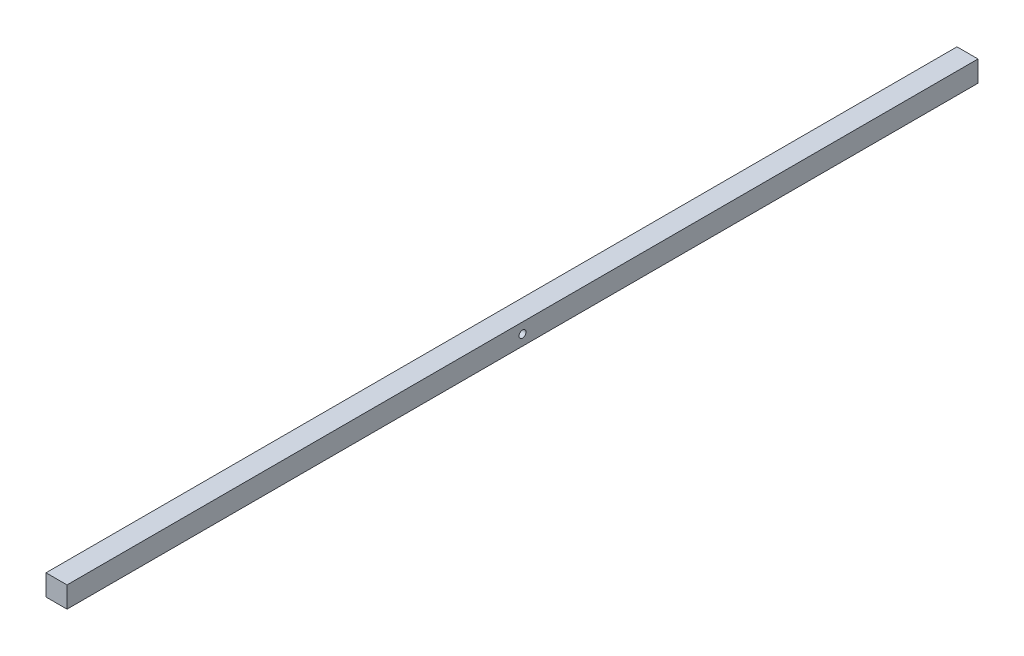
ISO-10303-21;
HEADER;
FILE_DESCRIPTION(('STEP AP214'),'2;1');
FILE_NAME('part.step','',(''),(''),'','','');
FILE_SCHEMA(('AUTOMOTIVE_DESIGN { 1 0 10303 214 1 1 1 1 }'));
ENDSEC;
DATA;
#1=APPLICATION_CONTEXT('core data for automotive mechanical design processes');
#2=APPLICATION_PROTOCOL_DEFINITION('international standard','automotive_design',2000,#1);
#3=PRODUCT_CONTEXT('',#1,'mechanical');
#4=PRODUCT('Part','Part','',(#3));
#5=PRODUCT_RELATED_PRODUCT_CATEGORY('part','',(#4));
#6=PRODUCT_DEFINITION_FORMATION('','',#4);
#7=PRODUCT_DEFINITION_CONTEXT('part definition',#1,'design');
#8=PRODUCT_DEFINITION('design','',#6,#7);
#9=PRODUCT_DEFINITION_SHAPE('','',#8);
#10=(LENGTH_UNIT() NAMED_UNIT(*) SI_UNIT(.MILLI.,.METRE.));
#11=(NAMED_UNIT(*) PLANE_ANGLE_UNIT() SI_UNIT($,.RADIAN.));
#12=(NAMED_UNIT(*) SI_UNIT($,.STERADIAN.) SOLID_ANGLE_UNIT());
#13=UNCERTAINTY_MEASURE_WITH_UNIT(LENGTH_MEASURE(1.E-05),#10,'distance_accuracy_value','');
#14=(GEOMETRIC_REPRESENTATION_CONTEXT(3) GLOBAL_UNCERTAINTY_ASSIGNED_CONTEXT((#13)) GLOBAL_UNIT_ASSIGNED_CONTEXT((#10,
#11,#12)) REPRESENTATION_CONTEXT('',''));
#15=CARTESIAN_POINT('',(0.,0.,0.));
#16=DIRECTION('',(0.,0.,1.));
#17=DIRECTION('',(1.,0.,0.));
#18=AXIS2_PLACEMENT_3D('',#15,#16,#17);
#19=CARTESIAN_POINT('',(3.,-3.,260.));
#20=DIRECTION('',(-1.,0.,0.));
#21=DIRECTION('',(0.,0.,1.));
#22=AXIS2_PLACEMENT_3D('',#19,#20,#21);
#23=PLANE('',#22);
#24=CARTESIAN_POINT('',(3.,0.,130.));
#25=DIRECTION('',(-1.,0.,0.));
#26=DIRECTION('',(0.,0.,1.));
#27=AXIS2_PLACEMENT_3D('',#24,#25,#26);
#28=CIRCLE('',#27,0.999999999999998);
#29=CARTESIAN_POINT('',(3.,0.,131.));
#30=VERTEX_POINT('',#29);
#31=EDGE_CURVE('E102',#30,#30,#28,.T.);
#32=ORIENTED_EDGE('',*,*,#31,.T.);
#33=EDGE_LOOP('',(#32));
#34=FACE_BOUND('',#33,.T.);
#35=DIRECTION('',(0.,1.,0.));
#36=VECTOR('',#35,1.);
#37=CARTESIAN_POINT('',(3.,-3.,0.));
#38=LINE('',#37,#36);
#39=CARTESIAN_POINT('',(3.,-3.,0.));
#40=VERTEX_POINT('',#39);
#41=CARTESIAN_POINT('',(3.,3.,0.));
#42=VERTEX_POINT('',#41);
#43=EDGE_CURVE('E99',#40,#42,#38,.T.);
#44=ORIENTED_EDGE('',*,*,#43,.T.);
#45=DIRECTION('',(0.,0.,-1.));
#46=VECTOR('',#45,1.);
#47=CARTESIAN_POINT('',(3.,3.,260.));
#48=LINE('',#47,#46);
#49=CARTESIAN_POINT('',(3.,3.,260.));
#50=VERTEX_POINT('',#49);
#51=EDGE_CURVE('E11',#50,#42,#48,.T.);
#52=ORIENTED_EDGE('',*,*,#51,.F.);
#53=DIRECTION('',(0.,1.,0.));
#54=VECTOR('',#53,1.);
#55=CARTESIAN_POINT('',(3.,-3.,260.));
#56=LINE('',#55,#54);
#57=CARTESIAN_POINT('',(3.,-3.,260.));
#58=VERTEX_POINT('',#57);
#59=EDGE_CURVE('E87',#58,#50,#56,.T.);
#60=ORIENTED_EDGE('',*,*,#59,.F.);
#61=DIRECTION('',(0.,0.,-1.));
#62=VECTOR('',#61,1.);
#63=CARTESIAN_POINT('',(3.,-3.,260.));
#64=LINE('',#63,#62);
#65=EDGE_CURVE('E95',#58,#40,#64,.T.);
#66=ORIENTED_EDGE('',*,*,#65,.T.);
#67=EDGE_LOOP('',(#44,#52,#60,#66));
#68=FACE_BOUND('',#67,.T.);
#69=ADVANCED_FACE('F36',(#34,#68),#23,.F.);
#70=CARTESIAN_POINT('',(-3.,3.,260.));
#71=DIRECTION('',(0.,-1.,0.));
#72=DIRECTION('',(0.,0.,-1.));
#73=AXIS2_PLACEMENT_3D('',#70,#71,#72);
#74=PLANE('',#73);
#75=DIRECTION('',(-1.,0.,0.));
#76=VECTOR('',#75,1.);
#77=CARTESIAN_POINT('',(-3.,3.,0.));
#78=LINE('',#77,#76);
#79=CARTESIAN_POINT('',(-3.,3.,0.));
#80=VERTEX_POINT('',#79);
#81=EDGE_CURVE('E91',#42,#80,#78,.T.);
#82=ORIENTED_EDGE('',*,*,#81,.T.);
#83=DIRECTION('',(0.,0.,-1.));
#84=VECTOR('',#83,1.);
#85=CARTESIAN_POINT('',(-3.,3.,260.));
#86=LINE('',#85,#84);
#87=CARTESIAN_POINT('',(-3.,3.,260.));
#88=VERTEX_POINT('',#87);
#89=EDGE_CURVE('E44',#88,#80,#86,.T.);
#90=ORIENTED_EDGE('',*,*,#89,.F.);
#91=DIRECTION('',(-1.,0.,0.));
#92=VECTOR('',#91,1.);
#93=CARTESIAN_POINT('',(-3.,3.,260.));
#94=LINE('',#93,#92);
#95=EDGE_CURVE('E82',#50,#88,#94,.T.);
#96=ORIENTED_EDGE('',*,*,#95,.F.);
#97=ORIENTED_EDGE('',*,*,#51,.T.);
#98=EDGE_LOOP('',(#82,#90,#96,#97));
#99=FACE_BOUND('',#98,.T.);
#100=ADVANCED_FACE('F90',(#99),#74,.F.);
#101=CARTESIAN_POINT('',(-3.,-3.,260.));
#102=DIRECTION('',(1.,0.,0.));
#103=DIRECTION('',(0.,0.,-1.));
#104=AXIS2_PLACEMENT_3D('',#101,#102,#103);
#105=PLANE('',#104);
#106=CARTESIAN_POINT('',(-3.,0.,130.));
#107=DIRECTION('',(-1.,0.,0.));
#108=DIRECTION('',(0.,0.,1.));
#109=AXIS2_PLACEMENT_3D('',#106,#107,#108);
#110=CIRCLE('',#109,0.999999999999998);
#111=CARTESIAN_POINT('',(-3.,0.,131.));
#112=VERTEX_POINT('',#111);
#113=EDGE_CURVE('E115',#112,#112,#110,.T.);
#114=ORIENTED_EDGE('',*,*,#113,.F.);
#115=EDGE_LOOP('',(#114));
#116=FACE_BOUND('',#115,.T.);
#117=DIRECTION('',(0.,-1.,0.));
#118=VECTOR('',#117,1.);
#119=CARTESIAN_POINT('',(-3.,-3.,0.));
#120=LINE('',#119,#118);
#121=CARTESIAN_POINT('',(-3.,-3.,0.));
#122=VERTEX_POINT('',#121);
#123=EDGE_CURVE('E69',#80,#122,#120,.T.);
#124=ORIENTED_EDGE('',*,*,#123,.T.);
#125=DIRECTION('',(0.,0.,-1.));
#126=VECTOR('',#125,1.);
#127=CARTESIAN_POINT('',(-3.,-3.,260.));
#128=LINE('',#127,#126);
#129=CARTESIAN_POINT('',(-3.,-3.,260.));
#130=VERTEX_POINT('',#129);
#131=EDGE_CURVE('E92',#130,#122,#128,.T.);
#132=ORIENTED_EDGE('',*,*,#131,.F.);
#133=DIRECTION('',(0.,-1.,0.));
#134=VECTOR('',#133,1.);
#135=CARTESIAN_POINT('',(-3.,-3.,260.));
#136=LINE('',#135,#134);
#137=EDGE_CURVE('E85',#88,#130,#136,.T.);
#138=ORIENTED_EDGE('',*,*,#137,.F.);
#139=ORIENTED_EDGE('',*,*,#89,.T.);
#140=EDGE_LOOP('',(#124,#132,#138,#139));
#141=FACE_BOUND('',#140,.T.);
#142=ADVANCED_FACE('F93',(#116,#141),#105,.F.);
#143=CARTESIAN_POINT('',(-3.,-3.,260.));
#144=DIRECTION('',(0.,1.,0.));
#145=DIRECTION('',(0.,0.,1.));
#146=AXIS2_PLACEMENT_3D('',#143,#144,#145);
#147=PLANE('',#146);
#148=DIRECTION('',(1.,0.,0.));
#149=VECTOR('',#148,1.);
#150=CARTESIAN_POINT('',(-3.,-3.,0.));
#151=LINE('',#150,#149);
#152=EDGE_CURVE('E75',#122,#40,#151,.T.);
#153=ORIENTED_EDGE('',*,*,#152,.T.);
#154=ORIENTED_EDGE('',*,*,#65,.F.);
#155=DIRECTION('',(1.,0.,0.));
#156=VECTOR('',#155,1.);
#157=CARTESIAN_POINT('',(-3.,-3.,260.));
#158=LINE('',#157,#156);
#159=EDGE_CURVE('E52',#130,#58,#158,.T.);
#160=ORIENTED_EDGE('',*,*,#159,.F.);
#161=ORIENTED_EDGE('',*,*,#131,.T.);
#162=EDGE_LOOP('',(#153,#154,#160,#161));
#163=FACE_BOUND('',#162,.T.);
#164=ADVANCED_FACE('F107',(#163),#147,.F.);
#165=CARTESIAN_POINT('',(0.,0.,260.));
#166=DIRECTION('',(0.,0.,-1.));
#167=DIRECTION('',(-1.,0.,0.));
#168=AXIS2_PLACEMENT_3D('',#165,#166,#167);
#169=PLANE('',#168);
#170=ORIENTED_EDGE('',*,*,#59,.T.);
#171=ORIENTED_EDGE('',*,*,#95,.T.);
#172=ORIENTED_EDGE('',*,*,#137,.T.);
#173=ORIENTED_EDGE('',*,*,#159,.T.);
#174=EDGE_LOOP('',(#170,#171,#172,#173));
#175=FACE_BOUND('',#174,.T.);
#176=ADVANCED_FACE('F83',(#175),#169,.F.);
#177=CARTESIAN_POINT('',(0.,0.,0.));
#178=DIRECTION('',(0.,0.,-1.));
#179=DIRECTION('',(-1.,0.,0.));
#180=AXIS2_PLACEMENT_3D('',#177,#178,#179);
#181=PLANE('',#180);
#182=ORIENTED_EDGE('',*,*,#43,.F.);
#183=ORIENTED_EDGE('',*,*,#152,.F.);
#184=ORIENTED_EDGE('',*,*,#123,.F.);
#185=ORIENTED_EDGE('',*,*,#81,.F.);
#186=EDGE_LOOP('',(#182,#183,#184,#185));
#187=FACE_BOUND('',#186,.T.);
#188=ADVANCED_FACE('F110',(#187),#181,.T.);
#189=CARTESIAN_POINT('',(7.,0.,130.));
#190=DIRECTION('',(-1.,0.,0.));
#191=DIRECTION('',(0.,0.,1.));
#192=AXIS2_PLACEMENT_3D('',#189,#190,#191);
#193=CYLINDRICAL_SURFACE('',#192,0.999999999999998);
#194=ORIENTED_EDGE('',*,*,#113,.T.);
#195=EDGE_LOOP('',(#194));
#196=FACE_BOUND('',#195,.T.);
#197=ORIENTED_EDGE('',*,*,#31,.F.);
#198=EDGE_LOOP('',(#197));
#199=FACE_BOUND('',#198,.T.);
#200=ADVANCED_FACE('F119',(#196,#199),#193,.F.);
#201=CLOSED_SHELL('',(#69,#100,#142,#164,#176,#188,#200));
#202=MANIFOLD_SOLID_BREP('B2',#201);
#203=ADVANCED_BREP_SHAPE_REPRESENTATION('',(#18,#202),#14);
#204=SHAPE_DEFINITION_REPRESENTATION(#9,#203);
ENDSEC;
END-ISO-10303-21;
